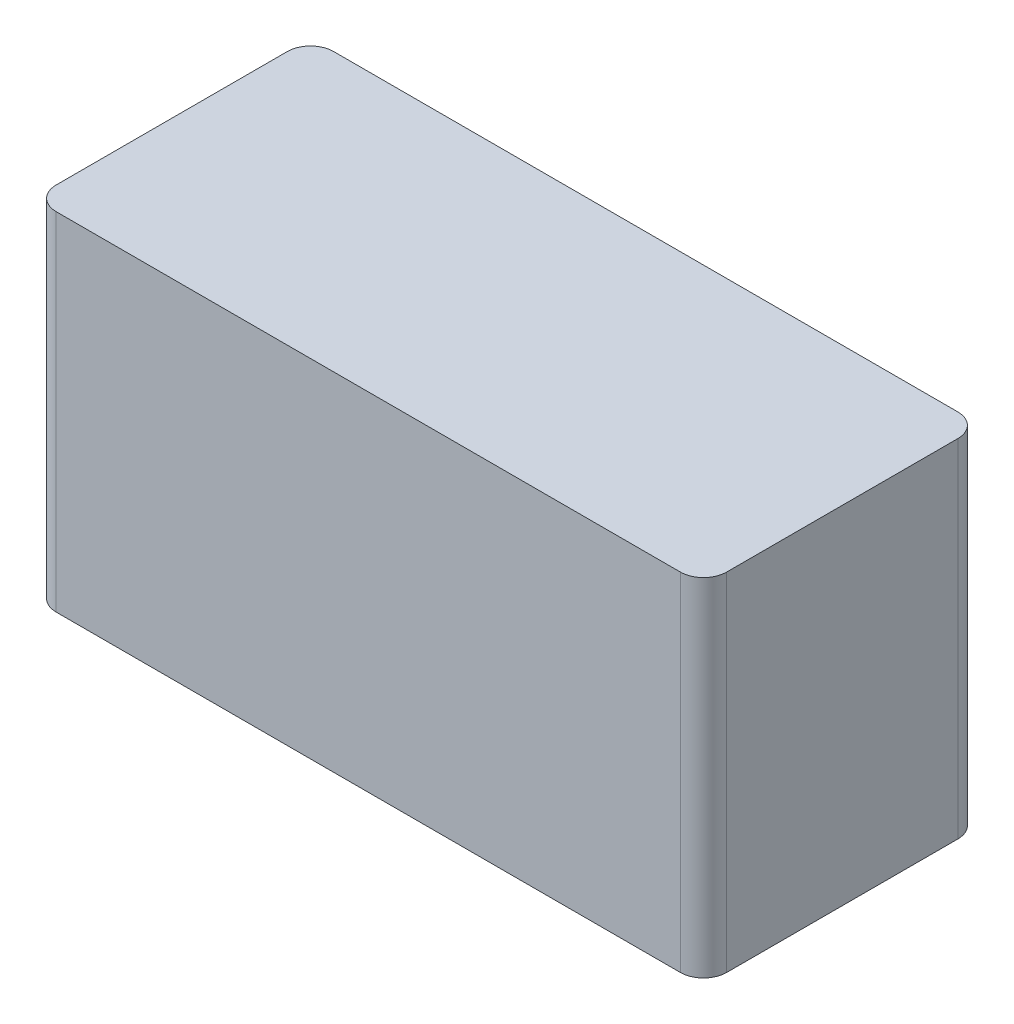
ISO-10303-21;
HEADER;
FILE_DESCRIPTION(('STEP AP214'),'2;1');
FILE_NAME('part.step','',(''),(''),'','','');
FILE_SCHEMA(('AUTOMOTIVE_DESIGN { 1 0 10303 214 1 1 1 1 }'));
ENDSEC;
DATA;
#1=APPLICATION_CONTEXT('core data for automotive mechanical design processes');
#2=APPLICATION_PROTOCOL_DEFINITION('international standard','automotive_design',2000,#1);
#3=PRODUCT_CONTEXT('',#1,'mechanical');
#4=PRODUCT('Part','Part','',(#3));
#5=PRODUCT_RELATED_PRODUCT_CATEGORY('part','',(#4));
#6=PRODUCT_DEFINITION_FORMATION('','',#4);
#7=PRODUCT_DEFINITION_CONTEXT('part definition',#1,'design');
#8=PRODUCT_DEFINITION('design','',#6,#7);
#9=PRODUCT_DEFINITION_SHAPE('','',#8);
#10=(LENGTH_UNIT() NAMED_UNIT(*) SI_UNIT(.MILLI.,.METRE.));
#11=(NAMED_UNIT(*) PLANE_ANGLE_UNIT() SI_UNIT($,.RADIAN.));
#12=(NAMED_UNIT(*) SI_UNIT($,.STERADIAN.) SOLID_ANGLE_UNIT());
#13=UNCERTAINTY_MEASURE_WITH_UNIT(LENGTH_MEASURE(1.E-05),#10,'distance_accuracy_value','');
#14=(GEOMETRIC_REPRESENTATION_CONTEXT(3) GLOBAL_UNCERTAINTY_ASSIGNED_CONTEXT((#13)) GLOBAL_UNIT_ASSIGNED_CONTEXT((#10,
#11,#12)) REPRESENTATION_CONTEXT('',''));
#15=CARTESIAN_POINT('',(0.,0.,0.));
#16=DIRECTION('',(0.,0.,1.));
#17=DIRECTION('',(1.,0.,0.));
#18=AXIS2_PLACEMENT_3D('',#15,#16,#17);
#19=CARTESIAN_POINT('',(-0.27,0.075,0.23));
#20=DIRECTION('',(0.,-1.,0.));
#21=DIRECTION('',(-0.707106781186546,0.,0.707106781186549));
#22=AXIS2_PLACEMENT_3D('',#19,#20,#21);
#23=CYLINDRICAL_SURFACE('',#22,0.02);
#24=CARTESIAN_POINT('',(-0.27,-0.15,0.23));
#25=DIRECTION('',(0.,1.,0.));
#26=DIRECTION('',(-0.707106781186546,0.,0.707106781186549));
#27=AXIS2_PLACEMENT_3D('',#24,#25,#26);
#28=CIRCLE('',#27,0.02);
#29=CARTESIAN_POINT('',(-0.29,-0.15,0.23));
#30=VERTEX_POINT('',#29);
#31=CARTESIAN_POINT('',(-0.27,-0.15,0.25));
#32=VERTEX_POINT('',#31);
#33=EDGE_CURVE('E11',#30,#32,#28,.T.);
#34=ORIENTED_EDGE('',*,*,#33,.T.);
#35=DIRECTION('',(0.,1.,0.));
#36=VECTOR('',#35,1.);
#37=CARTESIAN_POINT('',(-0.27,0.075,0.25));
#38=LINE('',#37,#36);
#39=CARTESIAN_POINT('',(-0.27,0.15,0.25));
#40=VERTEX_POINT('',#39);
#41=EDGE_CURVE('E24',#32,#40,#38,.T.);
#42=ORIENTED_EDGE('',*,*,#41,.T.);
#43=CARTESIAN_POINT('',(-0.27,0.15,0.23));
#44=DIRECTION('',(0.,-1.,0.));
#45=DIRECTION('',(-0.707106781186546,0.,0.707106781186549));
#46=AXIS2_PLACEMENT_3D('',#43,#44,#45);
#47=CIRCLE('',#46,0.02);
#48=CARTESIAN_POINT('',(-0.29,0.15,0.23));
#49=VERTEX_POINT('',#48);
#50=EDGE_CURVE('E143',#40,#49,#47,.T.);
#51=ORIENTED_EDGE('',*,*,#50,.T.);
#52=DIRECTION('',(0.,-1.,0.));
#53=VECTOR('',#52,1.);
#54=CARTESIAN_POINT('',(-0.29,0.075,0.23));
#55=LINE('',#54,#53);
#56=EDGE_CURVE('E141',#49,#30,#55,.T.);
#57=ORIENTED_EDGE('',*,*,#56,.T.);
#58=EDGE_LOOP('',(#34,#42,#51,#57));
#59=FACE_BOUND('',#58,.T.);
#60=ADVANCED_FACE('F17',(#59),#23,.T.);
#61=CARTESIAN_POINT('',(-0.29,0.15,0.0100000000000001));
#62=DIRECTION('',(-1.,0.,0.));
#63=DIRECTION('',(0.,0.,1.));
#64=AXIS2_PLACEMENT_3D('',#61,#62,#63);
#65=PLANE('',#64);
#66=ORIENTED_EDGE('',*,*,#56,.F.);
#67=DIRECTION('',(0.,0.,-1.));
#68=VECTOR('',#67,1.);
#69=CARTESIAN_POINT('',(-0.29,0.15,0.00500000000000013));
#70=LINE('',#69,#68);
#71=CARTESIAN_POINT('',(-0.29,0.15,0.03));
#72=VERTEX_POINT('',#71);
#73=EDGE_CURVE('E139',#49,#72,#70,.T.);
#74=ORIENTED_EDGE('',*,*,#73,.T.);
#75=DIRECTION('',(0.,1.,0.));
#76=VECTOR('',#75,1.);
#77=CARTESIAN_POINT('',(-0.29,0.075,0.03));
#78=LINE('',#77,#76);
#79=CARTESIAN_POINT('',(-0.29,-0.15,0.03));
#80=VERTEX_POINT('',#79);
#81=EDGE_CURVE('E136',#80,#72,#78,.T.);
#82=ORIENTED_EDGE('',*,*,#81,.F.);
#83=DIRECTION('',(0.,0.,1.));
#84=VECTOR('',#83,1.);
#85=CARTESIAN_POINT('',(-0.29,-0.15,0.00500000000000007));
#86=LINE('',#85,#84);
#87=EDGE_CURVE('E133',#80,#30,#86,.T.);
#88=ORIENTED_EDGE('',*,*,#87,.T.);
#89=EDGE_LOOP('',(#66,#74,#82,#88));
#90=FACE_BOUND('',#89,.T.);
#91=ADVANCED_FACE('F151',(#90),#65,.T.);
#92=CARTESIAN_POINT('',(0.3,0.15,0.));
#93=DIRECTION('',(0.,1.,0.));
#94=DIRECTION('',(-1.,0.,0.));
#95=AXIS2_PLACEMENT_3D('',#92,#93,#94);
#96=PLANE('',#95);
#97=ORIENTED_EDGE('',*,*,#50,.F.);
#98=DIRECTION('',(-1.,0.,0.));
#99=VECTOR('',#98,1.);
#100=CARTESIAN_POINT('',(0.00500000000000001,0.15,0.25));
#101=LINE('',#100,#99);
#102=CARTESIAN_POINT('',(0.27,0.15,0.25));
#103=VERTEX_POINT('',#102);
#104=EDGE_CURVE('E131',#103,#40,#101,.T.);
#105=ORIENTED_EDGE('',*,*,#104,.F.);
#106=CARTESIAN_POINT('',(0.27,0.15,0.23));
#107=DIRECTION('',(0.,-1.,0.));
#108=DIRECTION('',(0.707106781186548,0.,0.707106781186548));
#109=AXIS2_PLACEMENT_3D('',#106,#107,#108);
#110=CIRCLE('',#109,0.02);
#111=CARTESIAN_POINT('',(0.29,0.15,0.23));
#112=VERTEX_POINT('',#111);
#113=EDGE_CURVE('E84',#112,#103,#110,.T.);
#114=ORIENTED_EDGE('',*,*,#113,.F.);
#115=DIRECTION('',(0.,0.,1.));
#116=VECTOR('',#115,1.);
#117=CARTESIAN_POINT('',(0.29,0.15,0.125));
#118=LINE('',#117,#116);
#119=CARTESIAN_POINT('',(0.29,0.15,0.03));
#120=VERTEX_POINT('',#119);
#121=EDGE_CURVE('E127',#120,#112,#118,.T.);
#122=ORIENTED_EDGE('',*,*,#121,.F.);
#123=CARTESIAN_POINT('',(0.27,0.15,0.03));
#124=DIRECTION('',(0.,-1.,0.));
#125=DIRECTION('',(0.707106781186548,0.,-0.707106781186547));
#126=AXIS2_PLACEMENT_3D('',#123,#124,#125);
#127=CIRCLE('',#126,0.02);
#128=CARTESIAN_POINT('',(0.27,0.15,0.01));
#129=VERTEX_POINT('',#128);
#130=EDGE_CURVE('E124',#129,#120,#127,.T.);
#131=ORIENTED_EDGE('',*,*,#130,.F.);
#132=DIRECTION('',(1.,0.,0.));
#133=VECTOR('',#132,1.);
#134=CARTESIAN_POINT('',(0.295,0.15,0.01));
#135=LINE('',#134,#133);
#136=CARTESIAN_POINT('',(-0.27,0.15,0.0100000000000001));
#137=VERTEX_POINT('',#136);
#138=EDGE_CURVE('E121',#137,#129,#135,.T.);
#139=ORIENTED_EDGE('',*,*,#138,.F.);
#140=CARTESIAN_POINT('',(-0.27,0.15,0.03));
#141=DIRECTION('',(0.,-1.,0.));
#142=DIRECTION('',(-0.707106781186548,0.,-0.707106781186547));
#143=AXIS2_PLACEMENT_3D('',#140,#141,#142);
#144=CIRCLE('',#143,0.02);
#145=EDGE_CURVE('E118',#72,#137,#144,.T.);
#146=ORIENTED_EDGE('',*,*,#145,.F.);
#147=ORIENTED_EDGE('',*,*,#73,.F.);
#148=EDGE_LOOP('',(#97,#105,#114,#122,#131,#139,#146,#147));
#149=FACE_BOUND('',#148,.T.);
#150=ADVANCED_FACE('F148',(#149),#96,.T.);
#151=CARTESIAN_POINT('',(-0.27,0.075,0.03));
#152=DIRECTION('',(0.,1.,0.));
#153=DIRECTION('',(-0.707106781186548,0.,-0.707106781186547));
#154=AXIS2_PLACEMENT_3D('',#151,#152,#153);
#155=CYLINDRICAL_SURFACE('',#154,0.02);
#156=ORIENTED_EDGE('',*,*,#145,.T.);
#157=DIRECTION('',(0.,-1.,0.));
#158=VECTOR('',#157,1.);
#159=CARTESIAN_POINT('',(-0.27,0.075,0.01));
#160=LINE('',#159,#158);
#161=CARTESIAN_POINT('',(-0.27,-0.15,0.0100000000000001));
#162=VERTEX_POINT('',#161);
#163=EDGE_CURVE('E116',#137,#162,#160,.T.);
#164=ORIENTED_EDGE('',*,*,#163,.T.);
#165=CARTESIAN_POINT('',(-0.27,-0.15,0.03));
#166=DIRECTION('',(0.,1.,0.));
#167=DIRECTION('',(-0.707106781186548,0.,-0.707106781186547));
#168=AXIS2_PLACEMENT_3D('',#165,#166,#167);
#169=CIRCLE('',#168,0.02);
#170=EDGE_CURVE('E113',#162,#80,#169,.T.);
#171=ORIENTED_EDGE('',*,*,#170,.T.);
#172=ORIENTED_EDGE('',*,*,#81,.T.);
#173=EDGE_LOOP('',(#156,#164,#171,#172));
#174=FACE_BOUND('',#173,.T.);
#175=ADVANCED_FACE('F153',(#174),#155,.T.);
#176=CARTESIAN_POINT('',(0.,0.,0.01));
#177=DIRECTION('',(0.,0.,1.));
#178=DIRECTION('',(1.,0.,0.));
#179=AXIS2_PLACEMENT_3D('',#176,#177,#178);
#180=PLANE('',#179);
#181=ORIENTED_EDGE('',*,*,#163,.F.);
#182=ORIENTED_EDGE('',*,*,#138,.T.);
#183=DIRECTION('',(0.,1.,0.));
#184=VECTOR('',#183,1.);
#185=CARTESIAN_POINT('',(0.27,0.075,0.01));
#186=LINE('',#185,#184);
#187=CARTESIAN_POINT('',(0.27,-0.15,0.01));
#188=VERTEX_POINT('',#187);
#189=EDGE_CURVE('E110',#188,#129,#186,.T.);
#190=ORIENTED_EDGE('',*,*,#189,.F.);
#191=DIRECTION('',(-1.,0.,0.));
#192=VECTOR('',#191,1.);
#193=CARTESIAN_POINT('',(-0.005,-0.15,0.0100000000000001));
#194=LINE('',#193,#192);
#195=EDGE_CURVE('E107',#188,#162,#194,.T.);
#196=ORIENTED_EDGE('',*,*,#195,.T.);
#197=EDGE_LOOP('',(#181,#182,#190,#196));
#198=FACE_BOUND('',#197,.T.);
#199=ADVANCED_FACE('F158',(#198),#180,.F.);
#200=CARTESIAN_POINT('',(0.27,0.075,0.03));
#201=DIRECTION('',(0.,1.,0.));
#202=DIRECTION('',(0.707106781186548,0.,-0.707106781186547));
#203=AXIS2_PLACEMENT_3D('',#200,#201,#202);
#204=CYLINDRICAL_SURFACE('',#203,0.02);
#205=ORIENTED_EDGE('',*,*,#130,.T.);
#206=DIRECTION('',(0.,-1.,0.));
#207=VECTOR('',#206,1.);
#208=CARTESIAN_POINT('',(0.29,0.075,0.03));
#209=LINE('',#208,#207);
#210=CARTESIAN_POINT('',(0.29,-0.15,0.03));
#211=VERTEX_POINT('',#210);
#212=EDGE_CURVE('E105',#120,#211,#209,.T.);
#213=ORIENTED_EDGE('',*,*,#212,.T.);
#214=CARTESIAN_POINT('',(0.27,-0.15,0.03));
#215=DIRECTION('',(0.,1.,0.));
#216=DIRECTION('',(0.707106781186548,0.,-0.707106781186547));
#217=AXIS2_PLACEMENT_3D('',#214,#215,#216);
#218=CIRCLE('',#217,0.02);
#219=EDGE_CURVE('E102',#211,#188,#218,.T.);
#220=ORIENTED_EDGE('',*,*,#219,.T.);
#221=ORIENTED_EDGE('',*,*,#189,.T.);
#222=EDGE_LOOP('',(#205,#213,#220,#221));
#223=FACE_BOUND('',#222,.T.);
#224=ADVANCED_FACE('F160',(#223),#204,.T.);
#225=CARTESIAN_POINT('',(0.29,0.15,0.25));
#226=DIRECTION('',(1.,0.,0.));
#227=DIRECTION('',(0.,0.,-1.));
#228=AXIS2_PLACEMENT_3D('',#225,#226,#227);
#229=PLANE('',#228);
#230=ORIENTED_EDGE('',*,*,#212,.F.);
#231=ORIENTED_EDGE('',*,*,#121,.T.);
#232=DIRECTION('',(0.,1.,0.));
#233=VECTOR('',#232,1.);
#234=CARTESIAN_POINT('',(0.29,0.075,0.23));
#235=LINE('',#234,#233);
#236=CARTESIAN_POINT('',(0.29,-0.15,0.23));
#237=VERTEX_POINT('',#236);
#238=EDGE_CURVE('E100',#237,#112,#235,.T.);
#239=ORIENTED_EDGE('',*,*,#238,.F.);
#240=DIRECTION('',(0.,0.,-1.));
#241=VECTOR('',#240,1.);
#242=CARTESIAN_POINT('',(0.29,-0.15,0.125));
#243=LINE('',#242,#241);
#244=EDGE_CURVE('E88',#237,#211,#243,.T.);
#245=ORIENTED_EDGE('',*,*,#244,.T.);
#246=EDGE_LOOP('',(#230,#231,#239,#245));
#247=FACE_BOUND('',#246,.T.);
#248=ADVANCED_FACE('F163',(#247),#229,.T.);
#249=CARTESIAN_POINT('',(0.27,0.075,0.23));
#250=DIRECTION('',(0.,1.,0.));
#251=DIRECTION('',(0.707106781186548,0.,0.707106781186548));
#252=AXIS2_PLACEMENT_3D('',#249,#250,#251);
#253=CYLINDRICAL_SURFACE('',#252,0.02);
#254=ORIENTED_EDGE('',*,*,#113,.T.);
#255=DIRECTION('',(0.,-1.,0.));
#256=VECTOR('',#255,1.);
#257=CARTESIAN_POINT('',(0.27,0.075,0.25));
#258=LINE('',#257,#256);
#259=CARTESIAN_POINT('',(0.27,-0.15,0.25));
#260=VERTEX_POINT('',#259);
#261=EDGE_CURVE('E79',#103,#260,#258,.T.);
#262=ORIENTED_EDGE('',*,*,#261,.T.);
#263=CARTESIAN_POINT('',(0.27,-0.15,0.23));
#264=DIRECTION('',(0.,1.,0.));
#265=DIRECTION('',(0.707106781186548,0.,0.707106781186548));
#266=AXIS2_PLACEMENT_3D('',#263,#264,#265);
#267=CIRCLE('',#266,0.02);
#268=EDGE_CURVE('E83',#260,#237,#267,.T.);
#269=ORIENTED_EDGE('',*,*,#268,.T.);
#270=ORIENTED_EDGE('',*,*,#238,.T.);
#271=EDGE_LOOP('',(#254,#262,#269,#270));
#272=FACE_BOUND('',#271,.T.);
#273=ADVANCED_FACE('F81',(#272),#253,.T.);
#274=CARTESIAN_POINT('',(-0.3,-0.15,0.));
#275=DIRECTION('',(0.,-1.,0.));
#276=DIRECTION('',(1.,0.,0.));
#277=AXIS2_PLACEMENT_3D('',#274,#275,#276);
#278=PLANE('',#277);
#279=ORIENTED_EDGE('',*,*,#33,.F.);
#280=ORIENTED_EDGE('',*,*,#87,.F.);
#281=ORIENTED_EDGE('',*,*,#170,.F.);
#282=ORIENTED_EDGE('',*,*,#195,.F.);
#283=ORIENTED_EDGE('',*,*,#219,.F.);
#284=ORIENTED_EDGE('',*,*,#244,.F.);
#285=ORIENTED_EDGE('',*,*,#268,.F.);
#286=DIRECTION('',(1.,0.,0.));
#287=VECTOR('',#286,1.);
#288=CARTESIAN_POINT('',(-0.295,-0.15,0.25));
#289=LINE('',#288,#287);
#290=EDGE_CURVE('E92',#32,#260,#289,.T.);
#291=ORIENTED_EDGE('',*,*,#290,.F.);
#292=EDGE_LOOP('',(#279,#280,#281,#282,#283,#284,#285,#291));
#293=FACE_BOUND('',#292,.T.);
#294=ADVANCED_FACE('F91',(#293),#278,.T.);
#295=CARTESIAN_POINT('',(0.,0.,0.25));
#296=DIRECTION('',(0.,0.,-1.));
#297=DIRECTION('',(-1.,0.,0.));
#298=AXIS2_PLACEMENT_3D('',#295,#296,#297);
#299=PLANE('',#298);
#300=ORIENTED_EDGE('',*,*,#41,.F.);
#301=ORIENTED_EDGE('',*,*,#290,.T.);
#302=ORIENTED_EDGE('',*,*,#261,.F.);
#303=ORIENTED_EDGE('',*,*,#104,.T.);
#304=EDGE_LOOP('',(#300,#301,#302,#303));
#305=FACE_BOUND('',#304,.T.);
#306=ADVANCED_FACE('F96',(#305),#299,.F.);
#307=CLOSED_SHELL('',(#60,#91,#150,#175,#199,#224,#248,#273,#294,#306));
#308=MANIFOLD_SOLID_BREP('B1',#307);
#309=ADVANCED_BREP_SHAPE_REPRESENTATION('',(#18,#308),#14);
#310=SHAPE_DEFINITION_REPRESENTATION(#9,#309);
ENDSEC;
END-ISO-10303-21;
